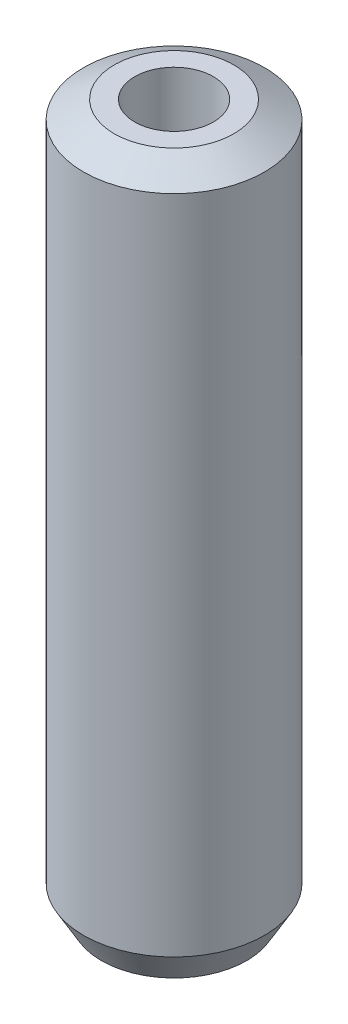
ISO-10303-21;
HEADER;
FILE_DESCRIPTION(('STEP AP214'),'2;1');
FILE_NAME('part.step','',(''),(''),'','','');
FILE_SCHEMA(('AUTOMOTIVE_DESIGN { 1 0 10303 214 1 1 1 1 }'));
ENDSEC;
DATA;
#1=APPLICATION_CONTEXT('core data for automotive mechanical design processes');
#2=APPLICATION_PROTOCOL_DEFINITION('international standard','automotive_design',2000,#1);
#3=PRODUCT_CONTEXT('',#1,'mechanical');
#4=PRODUCT('Part','Part','',(#3));
#5=PRODUCT_RELATED_PRODUCT_CATEGORY('part','',(#4));
#6=PRODUCT_DEFINITION_FORMATION('','',#4);
#7=PRODUCT_DEFINITION_CONTEXT('part definition',#1,'design');
#8=PRODUCT_DEFINITION('design','',#6,#7);
#9=PRODUCT_DEFINITION_SHAPE('','',#8);
#10=(LENGTH_UNIT() NAMED_UNIT(*) SI_UNIT(.MILLI.,.METRE.));
#11=(NAMED_UNIT(*) PLANE_ANGLE_UNIT() SI_UNIT($,.RADIAN.));
#12=(NAMED_UNIT(*) SI_UNIT($,.STERADIAN.) SOLID_ANGLE_UNIT());
#13=UNCERTAINTY_MEASURE_WITH_UNIT(LENGTH_MEASURE(1.E-05),#10,'distance_accuracy_value','');
#14=(GEOMETRIC_REPRESENTATION_CONTEXT(3) GLOBAL_UNCERTAINTY_ASSIGNED_CONTEXT((#13)) GLOBAL_UNIT_ASSIGNED_CONTEXT((#10,
#11,#12)) REPRESENTATION_CONTEXT('',''));
#15=CARTESIAN_POINT('',(0.,0.,0.));
#16=DIRECTION('',(0.,0.,1.));
#17=DIRECTION('',(1.,0.,0.));
#18=AXIS2_PLACEMENT_3D('',#15,#16,#17);
#19=CARTESIAN_POINT('',(0.,156.847978519537,0.));
#20=DIRECTION('',(0.,-1.,0.));
#21=DIRECTION('',(0.,0.,-1.));
#22=AXIS2_PLACEMENT_3D('',#19,#20,#21);
#23=CYLINDRICAL_SURFACE('',#22,20.);
#24=CARTESIAN_POINT('',(0.,152.924334776194,0.));
#25=DIRECTION('',(0.,1.,0.));
#26=DIRECTION('',(0.,0.,1.));
#27=AXIS2_PLACEMENT_3D('',#24,#25,#26);
#28=CIRCLE('',#27,20.);
#29=CARTESIAN_POINT('',(0.,152.924334776194,20.));
#30=VERTEX_POINT('',#29);
#31=EDGE_CURVE('E50',#30,#30,#28,.F.);
#32=ORIENTED_EDGE('',*,*,#31,.T.);
#33=EDGE_LOOP('',(#32));
#34=FACE_BOUND('',#33,.T.);
#35=CARTESIAN_POINT('',(0.,6.79595031426847,0.));
#36=DIRECTION('',(0.,1.,0.));
#37=DIRECTION('',(0.,0.,1.));
#38=AXIS2_PLACEMENT_3D('',#35,#36,#37);
#39=CIRCLE('',#38,20.);
#40=CARTESIAN_POINT('',(0.,6.79595031426847,20.));
#41=VERTEX_POINT('',#40);
#42=EDGE_CURVE('E51',#41,#41,#39,.T.);
#43=ORIENTED_EDGE('',*,*,#42,.T.);
#44=EDGE_LOOP('',(#43));
#45=FACE_BOUND('',#44,.T.);
#46=ADVANCED_FACE('F39',(#34,#45),#23,.T.);
#47=CARTESIAN_POINT('',(0.,156.847978519537,0.));
#48=DIRECTION('',(0.,1.,0.));
#49=DIRECTION('',(0.,0.,1.));
#50=AXIS2_PLACEMENT_3D('',#47,#48,#49);
#51=PLANE('',#50);
#52=CARTESIAN_POINT('',(0.,156.847978519537,0.));
#53=DIRECTION('',(0.,1.,0.));
#54=DIRECTION('',(0.,0.,1.));
#55=AXIS2_PLACEMENT_3D('',#52,#53,#54);
#56=CIRCLE('',#55,13.2040496857316);
#57=CARTESIAN_POINT('',(0.,156.847978519537,13.2040496857316));
#58=VERTEX_POINT('',#57);
#59=EDGE_CURVE('E54',#58,#58,#56,.T.);
#60=ORIENTED_EDGE('',*,*,#59,.T.);
#61=EDGE_LOOP('',(#60));
#62=FACE_BOUND('',#61,.T.);
#63=CARTESIAN_POINT('',(0.,156.847978519537,0.));
#64=DIRECTION('',(0.,1.,0.));
#65=DIRECTION('',(0.,0.,1.));
#66=AXIS2_PLACEMENT_3D('',#63,#64,#65);
#67=CIRCLE('',#66,8.69478168284148);
#68=CARTESIAN_POINT('',(0.,156.847978519537,8.69478168284148));
#69=VERTEX_POINT('',#68);
#70=EDGE_CURVE('E58',#69,#69,#67,.T.);
#71=ORIENTED_EDGE('',*,*,#70,.F.);
#72=EDGE_LOOP('',(#71));
#73=FACE_BOUND('',#72,.T.);
#74=ADVANCED_FACE('F69',(#62,#73),#51,.T.);
#75=CARTESIAN_POINT('',(0.,0.,0.));
#76=DIRECTION('',(0.,1.,0.));
#77=DIRECTION('',(0.,0.,1.));
#78=AXIS2_PLACEMENT_3D('',#75,#76,#77);
#79=PLANE('',#78);
#80=CARTESIAN_POINT('',(0.,0.,0.));
#81=DIRECTION('',(0.,1.,0.));
#82=DIRECTION('',(0.,0.,1.));
#83=AXIS2_PLACEMENT_3D('',#80,#81,#82);
#84=CIRCLE('',#83,16.0763562566577);
#85=CARTESIAN_POINT('',(0.,0.,16.0763562566577));
#86=VERTEX_POINT('',#85);
#87=EDGE_CURVE('E10',#86,#86,#84,.F.);
#88=ORIENTED_EDGE('',*,*,#87,.T.);
#89=EDGE_LOOP('',(#88));
#90=FACE_BOUND('',#89,.T.);
#91=CARTESIAN_POINT('',(0.,0.,0.));
#92=DIRECTION('',(0.,1.,0.));
#93=DIRECTION('',(0.,0.,1.));
#94=AXIS2_PLACEMENT_3D('',#91,#92,#93);
#95=CIRCLE('',#94,8.69478168284148);
#96=CARTESIAN_POINT('',(0.,0.,8.69478168284148));
#97=VERTEX_POINT('',#96);
#98=EDGE_CURVE('E63',#97,#97,#95,.T.);
#99=ORIENTED_EDGE('',*,*,#98,.T.);
#100=EDGE_LOOP('',(#99));
#101=FACE_BOUND('',#100,.T.);
#102=ADVANCED_FACE('F75',(#90,#101),#79,.F.);
#103=CARTESIAN_POINT('',(0.,156.847978519537,0.));
#104=DIRECTION('',(0.,-1.,0.));
#105=DIRECTION('',(0.,0.,-1.));
#106=AXIS2_PLACEMENT_3D('',#103,#104,#105);
#107=CYLINDRICAL_SURFACE('',#106,8.69478168284148);
#108=ORIENTED_EDGE('',*,*,#70,.T.);
#109=EDGE_LOOP('',(#108));
#110=FACE_BOUND('',#109,.T.);
#111=ORIENTED_EDGE('',*,*,#98,.F.);
#112=EDGE_LOOP('',(#111));
#113=FACE_BOUND('',#112,.T.);
#114=ADVANCED_FACE('F70',(#110,#113),#107,.F.);
#115=CARTESIAN_POINT('',(0.,156.847978519537,0.));
#116=DIRECTION('',(0.,-1.,0.));
#117=DIRECTION('',(0.,0.,-1.));
#118=AXIS2_PLACEMENT_3D('',#115,#116,#117);
#119=CONICAL_SURFACE('',#118,13.2040496857316,1.04719755119659);
#120=ORIENTED_EDGE('',*,*,#31,.F.);
#121=EDGE_LOOP('',(#120));
#122=FACE_BOUND('',#121,.T.);
#123=ORIENTED_EDGE('',*,*,#59,.F.);
#124=EDGE_LOOP('',(#123));
#125=FACE_BOUND('',#124,.T.);
#126=ADVANCED_FACE('F81',(#122,#125),#119,.T.);
#127=CARTESIAN_POINT('',(0.,6.79595031426847,0.));
#128=DIRECTION('',(0.,1.,0.));
#129=DIRECTION('',(0.,0.,1.));
#130=AXIS2_PLACEMENT_3D('',#127,#128,#129);
#131=CONICAL_SURFACE('',#130,20.,0.523598775598304);
#132=CARTESIAN_POINT('',(0.,0.,16.0763562566577));
#133=CARTESIAN_POINT('',(0.,0.0707911491069631,16.1172275456509));
#134=CARTESIAN_POINT('',(0.,0.141582298213926,16.158098834644));
#135=CARTESIAN_POINT('',(0.,0.283164596427852,16.2398414126303));
#136=CARTESIAN_POINT('',(0.,0.353955745534815,16.2807127016235));
#137=CARTESIAN_POINT('',(0.,0.495538043748741,16.3624552796098));
#138=CARTESIAN_POINT('',(0.,0.566329192855705,16.4033265686029));
#139=CARTESIAN_POINT('',(0.,0.707911491069631,16.4850691465892));
#140=CARTESIAN_POINT('',(0.,0.778702640176595,16.5259404355824));
#141=CARTESIAN_POINT('',(0.,0.920284938390521,16.6076830135687));
#142=CARTESIAN_POINT('',(0.,0.991076087497484,16.6485543025618));
#143=CARTESIAN_POINT('',(0.,1.13265838571141,16.7302968805481));
#144=CARTESIAN_POINT('',(0.,1.20344953481837,16.7711681695413));
#145=CARTESIAN_POINT('',(0.,1.3450318330323,16.8529107475276));
#146=CARTESIAN_POINT('',(0.,1.41582298213926,16.8937820365207));
#147=CARTESIAN_POINT('',(0.,1.55740528035319,16.975524614507));
#148=CARTESIAN_POINT('',(0.,1.62819642946015,17.0163959035002));
#149=CARTESIAN_POINT('',(0.,1.76977872767408,17.0981384814865));
#150=CARTESIAN_POINT('',(0.,1.84056987678104,17.1390097704796));
#151=CARTESIAN_POINT('',(0.,1.98215217499497,17.2207523484659));
#152=CARTESIAN_POINT('',(0.,2.05294332410193,17.261623637459));
#153=CARTESIAN_POINT('',(0.,2.19452562231586,17.3433662154453));
#154=CARTESIAN_POINT('',(0.,2.26531677142282,17.3842375044385));
#155=CARTESIAN_POINT('',(0.,2.40689906963675,17.4659800824248));
#156=CARTESIAN_POINT('',(0.,2.47769021874371,17.5068513714179));
#157=CARTESIAN_POINT('',(0.,2.61927251695764,17.5885939494042));
#158=CARTESIAN_POINT('',(0.,2.6900636660646,17.6294652383974));
#159=CARTESIAN_POINT('',(0.,2.83164596427853,17.7112078163837));
#160=CARTESIAN_POINT('',(0.,2.90243711338549,17.7520791053768));
#161=CARTESIAN_POINT('',(0.,3.04401941159942,17.8338216833631));
#162=CARTESIAN_POINT('',(0.,3.11481056070638,17.8746929723563));
#163=CARTESIAN_POINT('',(0.,3.25639285892031,17.9564355503426));
#164=CARTESIAN_POINT('',(0.,3.32718400802727,17.9973068393357));
#165=CARTESIAN_POINT('',(0.,3.4687663062412,18.079049417322));
#166=CARTESIAN_POINT('',(0.,3.53955745534816,18.1199207063152));
#167=CARTESIAN_POINT('',(0.,3.68113975356209,18.2016632843015));
#168=CARTESIAN_POINT('',(0.,3.75193090266905,18.2425345732946));
#169=CARTESIAN_POINT('',(0.,3.89351320088298,18.3242771512809));
#170=CARTESIAN_POINT('',(0.,3.96430434998994,18.3651484402741));
#171=CARTESIAN_POINT('',(0.,4.10588664820386,18.4468910182604));
#172=CARTESIAN_POINT('',(0.,4.17667779731083,18.4877623072535));
#173=CARTESIAN_POINT('',(0.,4.31826009552475,18.5695048852398));
#174=CARTESIAN_POINT('',(0.,4.38905124463172,18.610376174233));
#175=CARTESIAN_POINT('',(0.,4.53063354284564,18.6921187522192));
#176=CARTESIAN_POINT('',(0.,4.60142469195261,18.7329900412124));
#177=CARTESIAN_POINT('',(0.,4.74300699016653,18.8147326191987));
#178=CARTESIAN_POINT('',(0.,4.8137981392735,18.8556039081918));
#179=CARTESIAN_POINT('',(0.,4.95538043748742,18.9373464861781));
#180=CARTESIAN_POINT('',(0.,5.02617158659439,18.9782177751713));
#181=CARTESIAN_POINT('',(0.,5.16775388480831,19.0599603531576));
#182=CARTESIAN_POINT('',(0.,5.23854503391528,19.1008316421507));
#183=CARTESIAN_POINT('',(0.,5.3801273321292,19.182574220137));
#184=CARTESIAN_POINT('',(0.,5.45091848123617,19.2234455091302));
#185=CARTESIAN_POINT('',(0.,5.59250077945009,19.3051880871165));
#186=CARTESIAN_POINT('',(0.,5.66329192855706,19.3460593761096));
#187=CARTESIAN_POINT('',(0.,5.80487422677098,19.4278019540959));
#188=CARTESIAN_POINT('',(0.,5.87566537587795,19.4686732430891));
#189=CARTESIAN_POINT('',(0.,6.01724767409187,19.5504158210754));
#190=CARTESIAN_POINT('',(0.,6.08803882319884,19.5912871100685));
#191=CARTESIAN_POINT('',(0.,6.22962112141276,19.6730296880548));
#192=CARTESIAN_POINT('',(0.,6.30041227051972,19.713900977048));
#193=CARTESIAN_POINT('',(0.,6.44199456873365,19.7956435550343));
#194=CARTESIAN_POINT('',(0.,6.51278571784061,19.8365148440274));
#195=CARTESIAN_POINT('',(0.,6.65436801605454,19.9182574220137));
#196=CARTESIAN_POINT('',(0.,6.7251591651615,19.9591287110069));
#197=CARTESIAN_POINT('',(0.,6.79595031426847,20.));
#198=B_SPLINE_CURVE_WITH_KNOTS('',3,(#132,#133,#134,#135,#136,#137,#138,#139,#140,#141,#142,
#143,#144,#145,#146,#147,#148,#149,#150,#151,#152,#153,#154,#155,#156,#157,#158,#159,#160,#161,
#162,#163,#164,#165,#166,#167,#168,#169,#170,#171,#172,#173,#174,#175,#176,#177,#178,#179,#180,
#181,#182,#183,#184,#185,#186,#187,#188,#189,#190,#191,#192,#193,#194,#195,#196,#197),
.UNSPECIFIED.,.F.,.F.,(4,2,2,2,2,2,2,2,2,2,2,2,2,2,2,2,2,2,2,2,2,2,2,2,2,2,2,2,2,2,2,2,4),(0.,
0.245227733958888,0.490455467917779,0.735683201876667,0.980910935835557,1.22613866979445,
1.47136640375334,1.71659413771223,1.96182187167111,2.20704960563001,2.45227733958889,
2.69750507354778,2.94273280750667,3.18796054146556,3.43318827542445,3.67841600938334,
3.92364374334223,4.16887147730112,4.41409921126001,4.6593269452189,4.90455467917779,
5.14978241313668,5.39501014709557,5.64023788105446,5.88546561501335,6.13069334897224,
6.37592108293112,6.62114881689001,6.8663765508489,7.11160428480779,7.35683201876668,
7.60205975272557,7.84728748668446),.UNSPECIFIED.);
#199=EDGE_CURVE('BSEAM45',#86,#41,#198,.T.);
#200=ORIENTED_EDGE('',*,*,#87,.F.);
#201=ORIENTED_EDGE('',*,*,#42,.F.);
#202=ORIENTED_EDGE('',*,*,#199,.T.);
#203=ORIENTED_EDGE('',*,*,#199,.F.);
#204=EDGE_LOOP('',(#200,#202,#201,#203));
#205=FACE_BOUND('',#204,.T.);
#206=ADVANCED_FACE('F45',(#205),#131,.T.);
#207=CLOSED_SHELL('',(#46,#74,#102,#114,#126,#206));
#208=MANIFOLD_SOLID_BREP('B2',#207);
#209=ADVANCED_BREP_SHAPE_REPRESENTATION('',(#18,#208),#14);
#210=SHAPE_DEFINITION_REPRESENTATION(#9,#209);
ENDSEC;
END-ISO-10303-21;
